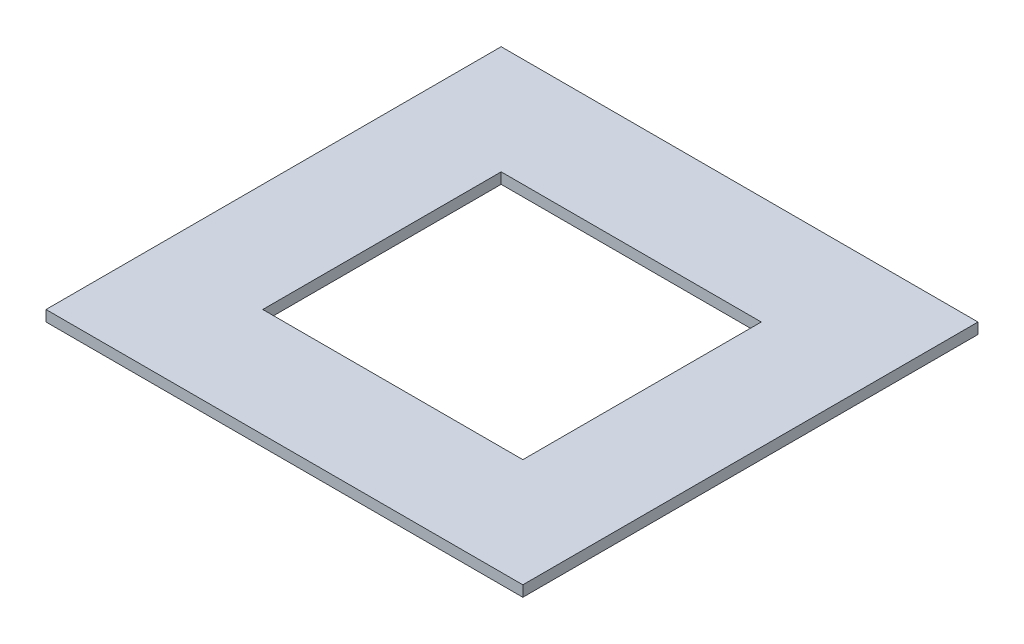
ISO-10303-21;
HEADER;
FILE_DESCRIPTION(('STEP AP214'),'2;1');
FILE_NAME('part.step','',(''),(''),'','','');
FILE_SCHEMA(('AUTOMOTIVE_DESIGN { 1 0 10303 214 1 1 1 1 }'));
ENDSEC;
DATA;
#1=APPLICATION_CONTEXT('core data for automotive mechanical design processes');
#2=APPLICATION_PROTOCOL_DEFINITION('international standard','automotive_design',2000,#1);
#3=PRODUCT_CONTEXT('',#1,'mechanical');
#4=PRODUCT('Part','Part','',(#3));
#5=PRODUCT_RELATED_PRODUCT_CATEGORY('part','',(#4));
#6=PRODUCT_DEFINITION_FORMATION('','',#4);
#7=PRODUCT_DEFINITION_CONTEXT('part definition',#1,'design');
#8=PRODUCT_DEFINITION('design','',#6,#7);
#9=PRODUCT_DEFINITION_SHAPE('','',#8);
#10=(LENGTH_UNIT() NAMED_UNIT(*) SI_UNIT(.MILLI.,.METRE.));
#11=(NAMED_UNIT(*) PLANE_ANGLE_UNIT() SI_UNIT($,.RADIAN.));
#12=(NAMED_UNIT(*) SI_UNIT($,.STERADIAN.) SOLID_ANGLE_UNIT());
#13=UNCERTAINTY_MEASURE_WITH_UNIT(LENGTH_MEASURE(1.E-05),#10,'distance_accuracy_value','');
#14=(GEOMETRIC_REPRESENTATION_CONTEXT(3) GLOBAL_UNCERTAINTY_ASSIGNED_CONTEXT((#13)) GLOBAL_UNIT_ASSIGNED_CONTEXT((#10,
#11,#12)) REPRESENTATION_CONTEXT('',''));
#15=CARTESIAN_POINT('',(0.,0.,0.));
#16=DIRECTION('',(0.,0.,1.));
#17=DIRECTION('',(1.,0.,0.));
#18=AXIS2_PLACEMENT_3D('',#15,#16,#17);
#19=CARTESIAN_POINT('',(0.,3.175,0.));
#20=DIRECTION('',(0.,1.,0.));
#21=DIRECTION('',(0.,0.,1.));
#22=AXIS2_PLACEMENT_3D('',#19,#20,#21);
#23=PLANE('',#22);
#24=DIRECTION('',(0.,0.,-1.));
#25=VECTOR('',#24,1.);
#26=CARTESIAN_POINT('',(0.,3.175,0.));
#27=LINE('',#26,#25);
#28=CARTESIAN_POINT('',(0.,3.175,0.));
#29=VERTEX_POINT('',#28);
#30=CARTESIAN_POINT('',(0.,3.175,-133.35));
#31=VERTEX_POINT('',#30);
#32=EDGE_CURVE('E134',#29,#31,#27,.T.);
#33=ORIENTED_EDGE('',*,*,#32,.T.);
#34=DIRECTION('',(-1.,0.,0.));
#35=VECTOR('',#34,1.);
#36=CARTESIAN_POINT('',(0.,3.175,-133.35));
#37=LINE('',#36,#35);
#38=CARTESIAN_POINT('',(-139.7,3.175,-133.35));
#39=VERTEX_POINT('',#38);
#40=EDGE_CURVE('E137',#31,#39,#37,.T.);
#41=ORIENTED_EDGE('',*,*,#40,.T.);
#42=DIRECTION('',(0.,0.,1.));
#43=VECTOR('',#42,1.);
#44=CARTESIAN_POINT('',(-139.7,3.175,0.));
#45=LINE('',#44,#43);
#46=CARTESIAN_POINT('',(-139.7,3.175,0.));
#47=VERTEX_POINT('',#46);
#48=EDGE_CURVE('E140',#39,#47,#45,.T.);
#49=ORIENTED_EDGE('',*,*,#48,.T.);
#50=DIRECTION('',(1.,0.,0.));
#51=VECTOR('',#50,1.);
#52=CARTESIAN_POINT('',(0.,3.175,0.));
#53=LINE('',#52,#51);
#54=EDGE_CURVE('E142',#47,#29,#53,.T.);
#55=ORIENTED_EDGE('',*,*,#54,.T.);
#56=EDGE_LOOP('',(#33,#41,#49,#55));
#57=FACE_BOUND('',#56,.T.);
#58=DIRECTION('',(1.,0.,0.));
#59=VECTOR('',#58,1.);
#60=CARTESIAN_POINT('',(-107.95,3.175,-31.75));
#61=LINE('',#60,#59);
#62=CARTESIAN_POINT('',(-107.95,3.175,-31.75));
#63=VERTEX_POINT('',#62);
#64=CARTESIAN_POINT('',(-31.75,3.175,-31.75));
#65=VERTEX_POINT('',#64);
#66=EDGE_CURVE('E106',#63,#65,#61,.T.);
#67=ORIENTED_EDGE('',*,*,#66,.F.);
#68=DIRECTION('',(0.,0.,1.));
#69=VECTOR('',#68,1.);
#70=CARTESIAN_POINT('',(-107.95,3.175,-101.6));
#71=LINE('',#70,#69);
#72=CARTESIAN_POINT('',(-107.95,3.175,-101.6));
#73=VERTEX_POINT('',#72);
#74=EDGE_CURVE('E98',#73,#63,#71,.T.);
#75=ORIENTED_EDGE('',*,*,#74,.F.);
#76=DIRECTION('',(-1.,0.,0.));
#77=VECTOR('',#76,1.);
#78=CARTESIAN_POINT('',(-107.95,3.175,-101.6));
#79=LINE('',#78,#77);
#80=CARTESIAN_POINT('',(-31.75,3.175,-101.6));
#81=VERTEX_POINT('',#80);
#82=EDGE_CURVE('E120',#81,#73,#79,.T.);
#83=ORIENTED_EDGE('',*,*,#82,.F.);
#84=DIRECTION('',(0.,0.,-1.));
#85=VECTOR('',#84,1.);
#86=CARTESIAN_POINT('',(-31.75,3.175,-101.6));
#87=LINE('',#86,#85);
#88=EDGE_CURVE('E118',#65,#81,#87,.T.);
#89=ORIENTED_EDGE('',*,*,#88,.F.);
#90=EDGE_LOOP('',(#67,#75,#83,#89));
#91=FACE_BOUND('',#90,.T.);
#92=ADVANCED_FACE('F33',(#57,#91),#23,.T.);
#93=CARTESIAN_POINT('',(0.,0.,0.));
#94=DIRECTION('',(0.,1.,0.));
#95=DIRECTION('',(0.,0.,1.));
#96=AXIS2_PLACEMENT_3D('',#93,#94,#95);
#97=PLANE('',#96);
#98=DIRECTION('',(0.,0.,-1.));
#99=VECTOR('',#98,1.);
#100=CARTESIAN_POINT('',(0.,0.,0.));
#101=LINE('',#100,#99);
#102=CARTESIAN_POINT('',(0.,0.,0.));
#103=VERTEX_POINT('',#102);
#104=CARTESIAN_POINT('',(0.,0.,-133.35));
#105=VERTEX_POINT('',#104);
#106=EDGE_CURVE('E114',#103,#105,#101,.T.);
#107=ORIENTED_EDGE('',*,*,#106,.F.);
#108=DIRECTION('',(1.,0.,0.));
#109=VECTOR('',#108,1.);
#110=CARTESIAN_POINT('',(0.,0.,0.));
#111=LINE('',#110,#109);
#112=CARTESIAN_POINT('',(-139.7,0.,0.));
#113=VERTEX_POINT('',#112);
#114=EDGE_CURVE('E138',#113,#103,#111,.T.);
#115=ORIENTED_EDGE('',*,*,#114,.F.);
#116=DIRECTION('',(0.,0.,1.));
#117=VECTOR('',#116,1.);
#118=CARTESIAN_POINT('',(-139.7,0.,0.));
#119=LINE('',#118,#117);
#120=CARTESIAN_POINT('',(-139.7,0.,-133.35));
#121=VERTEX_POINT('',#120);
#122=EDGE_CURVE('E149',#121,#113,#119,.T.);
#123=ORIENTED_EDGE('',*,*,#122,.F.);
#124=DIRECTION('',(-1.,0.,0.));
#125=VECTOR('',#124,1.);
#126=CARTESIAN_POINT('',(0.,0.,-133.35));
#127=LINE('',#126,#125);
#128=EDGE_CURVE('E147',#105,#121,#127,.T.);
#129=ORIENTED_EDGE('',*,*,#128,.F.);
#130=EDGE_LOOP('',(#107,#115,#123,#129));
#131=FACE_BOUND('',#130,.T.);
#132=DIRECTION('',(0.,0.,1.));
#133=VECTOR('',#132,1.);
#134=CARTESIAN_POINT('',(-107.95,0.,-101.6));
#135=LINE('',#134,#133);
#136=CARTESIAN_POINT('',(-107.95,0.,-101.6));
#137=VERTEX_POINT('',#136);
#138=CARTESIAN_POINT('',(-107.95,0.,-31.75));
#139=VERTEX_POINT('',#138);
#140=EDGE_CURVE('E56',#137,#139,#135,.T.);
#141=ORIENTED_EDGE('',*,*,#140,.T.);
#142=DIRECTION('',(1.,0.,0.));
#143=VECTOR('',#142,1.);
#144=CARTESIAN_POINT('',(-107.95,0.,-31.75));
#145=LINE('',#144,#143);
#146=CARTESIAN_POINT('',(-31.75,0.,-31.75));
#147=VERTEX_POINT('',#146);
#148=EDGE_CURVE('E113',#139,#147,#145,.T.);
#149=ORIENTED_EDGE('',*,*,#148,.T.);
#150=DIRECTION('',(0.,0.,-1.));
#151=VECTOR('',#150,1.);
#152=CARTESIAN_POINT('',(-31.75,0.,-101.6));
#153=LINE('',#152,#151);
#154=CARTESIAN_POINT('',(-31.75,0.,-101.6));
#155=VERTEX_POINT('',#154);
#156=EDGE_CURVE('E126',#147,#155,#153,.T.);
#157=ORIENTED_EDGE('',*,*,#156,.T.);
#158=DIRECTION('',(-1.,0.,0.));
#159=VECTOR('',#158,1.);
#160=CARTESIAN_POINT('',(-107.95,0.,-101.6));
#161=LINE('',#160,#159);
#162=EDGE_CURVE('E107',#155,#137,#161,.T.);
#163=ORIENTED_EDGE('',*,*,#162,.T.);
#164=EDGE_LOOP('',(#141,#149,#157,#163));
#165=FACE_BOUND('',#164,.T.);
#166=ADVANCED_FACE('F167',(#131,#165),#97,.F.);
#167=CARTESIAN_POINT('',(0.,3.175,0.));
#168=DIRECTION('',(-1.,0.,0.));
#169=DIRECTION('',(0.,0.,1.));
#170=AXIS2_PLACEMENT_3D('',#167,#168,#169);
#171=PLANE('',#170);
#172=ORIENTED_EDGE('',*,*,#106,.T.);
#173=DIRECTION('',(0.,-1.,0.));
#174=VECTOR('',#173,1.);
#175=CARTESIAN_POINT('',(0.,3.175,-133.35));
#176=LINE('',#175,#174);
#177=EDGE_CURVE('E11',#31,#105,#176,.T.);
#178=ORIENTED_EDGE('',*,*,#177,.F.);
#179=ORIENTED_EDGE('',*,*,#32,.F.);
#180=DIRECTION('',(0.,-1.,0.));
#181=VECTOR('',#180,1.);
#182=CARTESIAN_POINT('',(0.,3.175,0.));
#183=LINE('',#182,#181);
#184=EDGE_CURVE('E144',#29,#103,#183,.T.);
#185=ORIENTED_EDGE('',*,*,#184,.T.);
#186=EDGE_LOOP('',(#172,#178,#179,#185));
#187=FACE_BOUND('',#186,.T.);
#188=ADVANCED_FACE('F35',(#187),#171,.F.);
#189=CARTESIAN_POINT('',(0.,3.175,-133.35));
#190=DIRECTION('',(0.,0.,1.));
#191=DIRECTION('',(1.,0.,0.));
#192=AXIS2_PLACEMENT_3D('',#189,#190,#191);
#193=PLANE('',#192);
#194=ORIENTED_EDGE('',*,*,#128,.T.);
#195=DIRECTION('',(0.,-1.,0.));
#196=VECTOR('',#195,1.);
#197=CARTESIAN_POINT('',(-139.7,3.175,-133.35));
#198=LINE('',#197,#196);
#199=EDGE_CURVE('E41',#39,#121,#198,.T.);
#200=ORIENTED_EDGE('',*,*,#199,.F.);
#201=ORIENTED_EDGE('',*,*,#40,.F.);
#202=ORIENTED_EDGE('',*,*,#177,.T.);
#203=EDGE_LOOP('',(#194,#200,#201,#202));
#204=FACE_BOUND('',#203,.T.);
#205=ADVANCED_FACE('F177',(#204),#193,.F.);
#206=CARTESIAN_POINT('',(-139.7,3.175,0.));
#207=DIRECTION('',(1.,0.,0.));
#208=DIRECTION('',(0.,0.,-1.));
#209=AXIS2_PLACEMENT_3D('',#206,#207,#208);
#210=PLANE('',#209);
#211=ORIENTED_EDGE('',*,*,#122,.T.);
#212=DIRECTION('',(0.,-1.,0.));
#213=VECTOR('',#212,1.);
#214=CARTESIAN_POINT('',(-139.7,3.175,0.));
#215=LINE('',#214,#213);
#216=EDGE_CURVE('E154',#47,#113,#215,.T.);
#217=ORIENTED_EDGE('',*,*,#216,.F.);
#218=ORIENTED_EDGE('',*,*,#48,.F.);
#219=ORIENTED_EDGE('',*,*,#199,.T.);
#220=EDGE_LOOP('',(#211,#217,#218,#219));
#221=FACE_BOUND('',#220,.T.);
#222=ADVANCED_FACE('F161',(#221),#210,.F.);
#223=CARTESIAN_POINT('',(0.,3.175,0.));
#224=DIRECTION('',(0.,0.,-1.));
#225=DIRECTION('',(-1.,0.,0.));
#226=AXIS2_PLACEMENT_3D('',#223,#224,#225);
#227=PLANE('',#226);
#228=ORIENTED_EDGE('',*,*,#114,.T.);
#229=ORIENTED_EDGE('',*,*,#184,.F.);
#230=ORIENTED_EDGE('',*,*,#54,.F.);
#231=ORIENTED_EDGE('',*,*,#216,.T.);
#232=EDGE_LOOP('',(#228,#229,#230,#231));
#233=FACE_BOUND('',#232,.T.);
#234=ADVANCED_FACE('F171',(#233),#227,.F.);
#235=CARTESIAN_POINT('',(-107.95,3.175,-101.6));
#236=DIRECTION('',(1.,0.,0.));
#237=DIRECTION('',(0.,0.,-1.));
#238=AXIS2_PLACEMENT_3D('',#235,#236,#237);
#239=PLANE('',#238);
#240=ORIENTED_EDGE('',*,*,#140,.F.);
#241=DIRECTION('',(0.,-1.,0.));
#242=VECTOR('',#241,1.);
#243=CARTESIAN_POINT('',(-107.95,3.175,-101.6));
#244=LINE('',#243,#242);
#245=EDGE_CURVE('E102',#73,#137,#244,.T.);
#246=ORIENTED_EDGE('',*,*,#245,.F.);
#247=ORIENTED_EDGE('',*,*,#74,.T.);
#248=DIRECTION('',(0.,-1.,0.));
#249=VECTOR('',#248,1.);
#250=CARTESIAN_POINT('',(-107.95,3.175,-31.75));
#251=LINE('',#250,#249);
#252=EDGE_CURVE('E101',#63,#139,#251,.T.);
#253=ORIENTED_EDGE('',*,*,#252,.T.);
#254=EDGE_LOOP('',(#240,#246,#247,#253));
#255=FACE_BOUND('',#254,.T.);
#256=ADVANCED_FACE('F100',(#255),#239,.T.);
#257=CARTESIAN_POINT('',(-107.95,3.175,-31.75));
#258=DIRECTION('',(0.,0.,-1.));
#259=DIRECTION('',(-1.,0.,0.));
#260=AXIS2_PLACEMENT_3D('',#257,#258,#259);
#261=PLANE('',#260);
#262=ORIENTED_EDGE('',*,*,#148,.F.);
#263=ORIENTED_EDGE('',*,*,#252,.F.);
#264=ORIENTED_EDGE('',*,*,#66,.T.);
#265=DIRECTION('',(0.,-1.,0.));
#266=VECTOR('',#265,1.);
#267=CARTESIAN_POINT('',(-31.75,3.175,-31.75));
#268=LINE('',#267,#266);
#269=EDGE_CURVE('E115',#65,#147,#268,.T.);
#270=ORIENTED_EDGE('',*,*,#269,.T.);
#271=EDGE_LOOP('',(#262,#263,#264,#270));
#272=FACE_BOUND('',#271,.T.);
#273=ADVANCED_FACE('F110',(#272),#261,.T.);
#274=CARTESIAN_POINT('',(-31.75,3.175,-101.6));
#275=DIRECTION('',(-1.,0.,0.));
#276=DIRECTION('',(0.,0.,1.));
#277=AXIS2_PLACEMENT_3D('',#274,#275,#276);
#278=PLANE('',#277);
#279=ORIENTED_EDGE('',*,*,#156,.F.);
#280=ORIENTED_EDGE('',*,*,#269,.F.);
#281=ORIENTED_EDGE('',*,*,#88,.T.);
#282=DIRECTION('',(0.,-1.,0.));
#283=VECTOR('',#282,1.);
#284=CARTESIAN_POINT('',(-31.75,3.175,-101.6));
#285=LINE('',#284,#283);
#286=EDGE_CURVE('E48',#81,#155,#285,.T.);
#287=ORIENTED_EDGE('',*,*,#286,.T.);
#288=EDGE_LOOP('',(#279,#280,#281,#287));
#289=FACE_BOUND('',#288,.T.);
#290=ADVANCED_FACE('F200',(#289),#278,.T.);
#291=CARTESIAN_POINT('',(-107.95,3.175,-101.6));
#292=DIRECTION('',(0.,0.,1.));
#293=DIRECTION('',(1.,0.,0.));
#294=AXIS2_PLACEMENT_3D('',#291,#292,#293);
#295=PLANE('',#294);
#296=ORIENTED_EDGE('',*,*,#162,.F.);
#297=ORIENTED_EDGE('',*,*,#286,.F.);
#298=ORIENTED_EDGE('',*,*,#82,.T.);
#299=ORIENTED_EDGE('',*,*,#245,.T.);
#300=EDGE_LOOP('',(#296,#297,#298,#299));
#301=FACE_BOUND('',#300,.T.);
#302=ADVANCED_FACE('F204',(#301),#295,.T.);
#303=CLOSED_SHELL('',(#92,#166,#188,#205,#222,#234,#256,#273,#290,#302));
#304=MANIFOLD_SOLID_BREP('B2',#303);
#305=ADVANCED_BREP_SHAPE_REPRESENTATION('',(#18,#304),#14);
#306=SHAPE_DEFINITION_REPRESENTATION(#9,#305);
ENDSEC;
END-ISO-10303-21;
